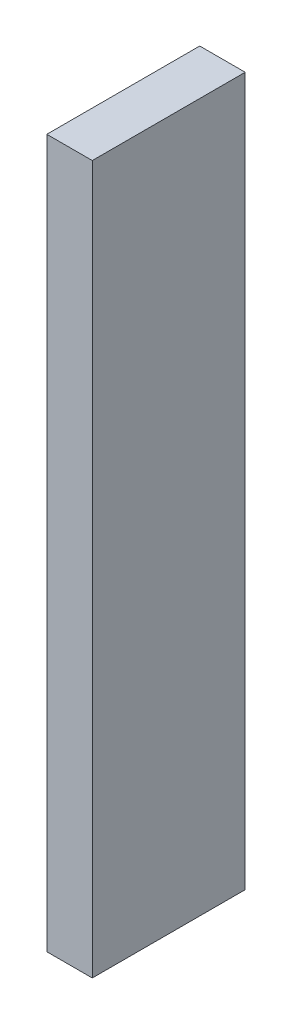
ISO-10303-21;
HEADER;
FILE_DESCRIPTION(('STEP AP214'),'2;1');
FILE_NAME('part.step','',(''),(''),'','','');
FILE_SCHEMA(('AUTOMOTIVE_DESIGN { 1 0 10303 214 1 1 1 1 }'));
ENDSEC;
DATA;
#1=APPLICATION_CONTEXT('core data for automotive mechanical design processes');
#2=APPLICATION_PROTOCOL_DEFINITION('international standard','automotive_design',2000,#1);
#3=PRODUCT_CONTEXT('',#1,'mechanical');
#4=PRODUCT('Part','Part','',(#3));
#5=PRODUCT_RELATED_PRODUCT_CATEGORY('part','',(#4));
#6=PRODUCT_DEFINITION_FORMATION('','',#4);
#7=PRODUCT_DEFINITION_CONTEXT('part definition',#1,'design');
#8=PRODUCT_DEFINITION('design','',#6,#7);
#9=PRODUCT_DEFINITION_SHAPE('','',#8);
#10=(LENGTH_UNIT() NAMED_UNIT(*) SI_UNIT(.MILLI.,.METRE.));
#11=(NAMED_UNIT(*) PLANE_ANGLE_UNIT() SI_UNIT($,.RADIAN.));
#12=(NAMED_UNIT(*) SI_UNIT($,.STERADIAN.) SOLID_ANGLE_UNIT());
#13=UNCERTAINTY_MEASURE_WITH_UNIT(LENGTH_MEASURE(1.E-05),#10,'distance_accuracy_value','');
#14=(GEOMETRIC_REPRESENTATION_CONTEXT(3) GLOBAL_UNCERTAINTY_ASSIGNED_CONTEXT((#13)) GLOBAL_UNIT_ASSIGNED_CONTEXT((#10,
#11,#12)) REPRESENTATION_CONTEXT('',''));
#15=CARTESIAN_POINT('',(0.,0.,0.));
#16=DIRECTION('',(0.,0.,1.));
#17=DIRECTION('',(1.,0.,0.));
#18=AXIS2_PLACEMENT_3D('',#15,#16,#17);
#19=CARTESIAN_POINT('',(130.27554525479,22.4180708263693,61.072028202897));
#20=DIRECTION('',(-1.69244514382854E-09,0.,1.));
#21=DIRECTION('',(1.,0.,1.69244514382854E-09));
#22=AXIS2_PLACEMENT_3D('',#19,#20,#21);
#23=PLANE('',#22);
#24=DIRECTION('',(0.,-1.,0.));
#25=VECTOR('',#24,1.);
#26=CARTESIAN_POINT('',(131.258630351803,22.4180708263693,61.0720282045608));
#27=LINE('',#26,#25);
#28=CARTESIAN_POINT('',(131.258630351803,22.4180708263693,61.0720282045608));
#29=VERTEX_POINT('',#28);
#30=CARTESIAN_POINT('',(131.258630351803,7.11212965552236,61.0720282045608));
#31=VERTEX_POINT('',#30);
#32=EDGE_CURVE('E79',#29,#31,#27,.T.);
#33=ORIENTED_EDGE('',*,*,#32,.F.);
#34=DIRECTION('',(1.,0.,1.69244514382854E-09));
#35=VECTOR('',#34,1.);
#36=CARTESIAN_POINT('',(130.27554525479,22.4180708263693,61.072028202897));
#37=LINE('',#36,#35);
#38=CARTESIAN_POINT('',(130.27554525479,22.4180708263693,61.072028202897));
#39=VERTEX_POINT('',#38);
#40=EDGE_CURVE('E32',#39,#29,#37,.T.);
#41=ORIENTED_EDGE('',*,*,#40,.F.);
#42=DIRECTION('',(0.,-1.,0.));
#43=VECTOR('',#42,1.);
#44=CARTESIAN_POINT('',(130.27554525479,22.4180708263693,61.072028202897));
#45=LINE('',#44,#43);
#46=CARTESIAN_POINT('',(130.27554525479,7.11212965552236,61.0720282028969));
#47=VERTEX_POINT('',#46);
#48=EDGE_CURVE('E71',#39,#47,#45,.T.);
#49=ORIENTED_EDGE('',*,*,#48,.T.);
#50=DIRECTION('',(1.,0.,1.69244514382854E-09));
#51=VECTOR('',#50,1.);
#52=CARTESIAN_POINT('',(130.27554525479,7.11212965552236,61.0720282028969));
#53=LINE('',#52,#51);
#54=EDGE_CURVE('E10',#47,#31,#53,.T.);
#55=ORIENTED_EDGE('',*,*,#54,.T.);
#56=EDGE_LOOP('',(#33,#41,#49,#55));
#57=FACE_BOUND('',#56,.T.);
#58=ADVANCED_FACE('F16',(#57),#23,.T.);
#59=CARTESIAN_POINT('',(130.27554525479,7.11212965552236,61.0720282028969));
#60=DIRECTION('',(0.,-1.,0.));
#61=DIRECTION('',(0.,0.,-1.));
#62=AXIS2_PLACEMENT_3D('',#59,#60,#61);
#63=PLANE('',#62);
#64=DIRECTION('',(1.69244514382854E-09,0.,-1.));
#65=VECTOR('',#64,1.);
#66=CARTESIAN_POINT('',(131.258630351803,7.11212965552236,61.0720282045608));
#67=LINE('',#66,#65);
#68=CARTESIAN_POINT('',(131.258630357398,7.11212965552235,57.766087033712));
#69=VERTEX_POINT('',#68);
#70=EDGE_CURVE('E82',#31,#69,#67,.T.);
#71=ORIENTED_EDGE('',*,*,#70,.F.);
#72=ORIENTED_EDGE('',*,*,#54,.F.);
#73=DIRECTION('',(1.69244514382854E-09,0.,-1.));
#74=VECTOR('',#73,1.);
#75=CARTESIAN_POINT('',(130.27554525479,7.11212965552236,61.0720282028969));
#76=LINE('',#75,#74);
#77=CARTESIAN_POINT('',(130.275545260385,7.11212965552235,57.7660870320482));
#78=VERTEX_POINT('',#77);
#79=EDGE_CURVE('E67',#47,#78,#76,.T.);
#80=ORIENTED_EDGE('',*,*,#79,.T.);
#81=DIRECTION('',(1.,0.,1.69244514382854E-09));
#82=VECTOR('',#81,1.);
#83=CARTESIAN_POINT('',(130.275545260385,7.11212965552235,57.7660870320482));
#84=LINE('',#83,#82);
#85=EDGE_CURVE('E24',#78,#69,#84,.T.);
#86=ORIENTED_EDGE('',*,*,#85,.T.);
#87=EDGE_LOOP('',(#71,#72,#80,#86));
#88=FACE_BOUND('',#87,.T.);
#89=ADVANCED_FACE('F68',(#88),#63,.T.);
#90=CARTESIAN_POINT('',(130.275545260385,7.11212965552235,57.7660870320482));
#91=DIRECTION('',(1.69244514382854E-09,0.,-1.));
#92=DIRECTION('',(-1.,0.,-1.69244514382854E-09));
#93=AXIS2_PLACEMENT_3D('',#90,#91,#92);
#94=PLANE('',#93);
#95=DIRECTION('',(0.,1.,0.));
#96=VECTOR('',#95,1.);
#97=CARTESIAN_POINT('',(131.258630357398,7.11212965552235,57.766087033712));
#98=LINE('',#97,#96);
#99=CARTESIAN_POINT('',(131.258630357398,22.418070826371,57.7660870252515));
#100=VERTEX_POINT('',#99);
#101=EDGE_CURVE('E65',#69,#100,#98,.T.);
#102=ORIENTED_EDGE('',*,*,#101,.F.);
#103=ORIENTED_EDGE('',*,*,#85,.F.);
#104=DIRECTION('',(0.,1.,0.));
#105=VECTOR('',#104,1.);
#106=CARTESIAN_POINT('',(130.275545260385,7.11212965552235,57.7660870320482));
#107=LINE('',#106,#105);
#108=CARTESIAN_POINT('',(130.275545260385,22.418070826371,57.7660870235876));
#109=VERTEX_POINT('',#108);
#110=EDGE_CURVE('E62',#78,#109,#107,.T.);
#111=ORIENTED_EDGE('',*,*,#110,.T.);
#112=DIRECTION('',(1.,0.,1.69244514382854E-09));
#113=VECTOR('',#112,1.);
#114=CARTESIAN_POINT('',(130.275545260385,22.418070826371,57.7660870235876));
#115=LINE('',#114,#113);
#116=EDGE_CURVE('E48',#109,#100,#115,.T.);
#117=ORIENTED_EDGE('',*,*,#116,.T.);
#118=EDGE_LOOP('',(#102,#103,#111,#117));
#119=FACE_BOUND('',#118,.T.);
#120=ADVANCED_FACE('F60',(#119),#94,.T.);
#121=CARTESIAN_POINT('',(130.275545260385,22.418070826371,57.7660870235876));
#122=DIRECTION('',(0.,1.,0.));
#123=DIRECTION('',(-1.,0.,0.));
#124=AXIS2_PLACEMENT_3D('',#121,#122,#123);
#125=PLANE('',#124);
#126=DIRECTION('',(-1.69244514382854E-09,0.,1.));
#127=VECTOR('',#126,1.);
#128=CARTESIAN_POINT('',(131.258630357398,22.418070826371,57.7660870252515));
#129=LINE('',#128,#127);
#130=EDGE_CURVE('E85',#100,#29,#129,.T.);
#131=ORIENTED_EDGE('',*,*,#130,.F.);
#132=ORIENTED_EDGE('',*,*,#116,.F.);
#133=DIRECTION('',(-1.69244514382854E-09,0.,1.));
#134=VECTOR('',#133,1.);
#135=CARTESIAN_POINT('',(130.275545260385,22.418070826371,57.7660870235876));
#136=LINE('',#135,#134);
#137=EDGE_CURVE('E74',#109,#39,#136,.T.);
#138=ORIENTED_EDGE('',*,*,#137,.T.);
#139=ORIENTED_EDGE('',*,*,#40,.T.);
#140=EDGE_LOOP('',(#131,#132,#138,#139));
#141=FACE_BOUND('',#140,.T.);
#142=ADVANCED_FACE('F96',(#141),#125,.T.);
#143=CARTESIAN_POINT('',(130.275545201028,17.2651002409467,92.8378644340291));
#144=DIRECTION('',(1.,0.,1.69244514382854E-09));
#145=DIRECTION('',(0.,1.,0.));
#146=AXIS2_PLACEMENT_3D('',#143,#144,#145);
#147=PLANE('',#146);
#148=ORIENTED_EDGE('',*,*,#48,.F.);
#149=ORIENTED_EDGE('',*,*,#137,.F.);
#150=ORIENTED_EDGE('',*,*,#110,.F.);
#151=ORIENTED_EDGE('',*,*,#79,.F.);
#152=EDGE_LOOP('',(#148,#149,#150,#151));
#153=FACE_BOUND('',#152,.T.);
#154=ADVANCED_FACE('F73',(#153),#147,.F.);
#155=CARTESIAN_POINT('',(131.258630298041,17.2651002409467,92.8378644356929));
#156=DIRECTION('',(1.,0.,1.69244514382854E-09));
#157=DIRECTION('',(0.,1.,0.));
#158=AXIS2_PLACEMENT_3D('',#155,#156,#157);
#159=PLANE('',#158);
#160=ORIENTED_EDGE('',*,*,#32,.T.);
#161=ORIENTED_EDGE('',*,*,#70,.T.);
#162=ORIENTED_EDGE('',*,*,#101,.T.);
#163=ORIENTED_EDGE('',*,*,#130,.T.);
#164=EDGE_LOOP('',(#160,#161,#162,#163));
#165=FACE_BOUND('',#164,.T.);
#166=ADVANCED_FACE('F89',(#165),#159,.T.);
#167=CLOSED_SHELL('',(#58,#89,#120,#142,#154,#166));
#168=MANIFOLD_SOLID_BREP('B1',#167);
#169=ADVANCED_BREP_SHAPE_REPRESENTATION('',(#18,#168),#14);
#170=SHAPE_DEFINITION_REPRESENTATION(#9,#169);
ENDSEC;
END-ISO-10303-21;
